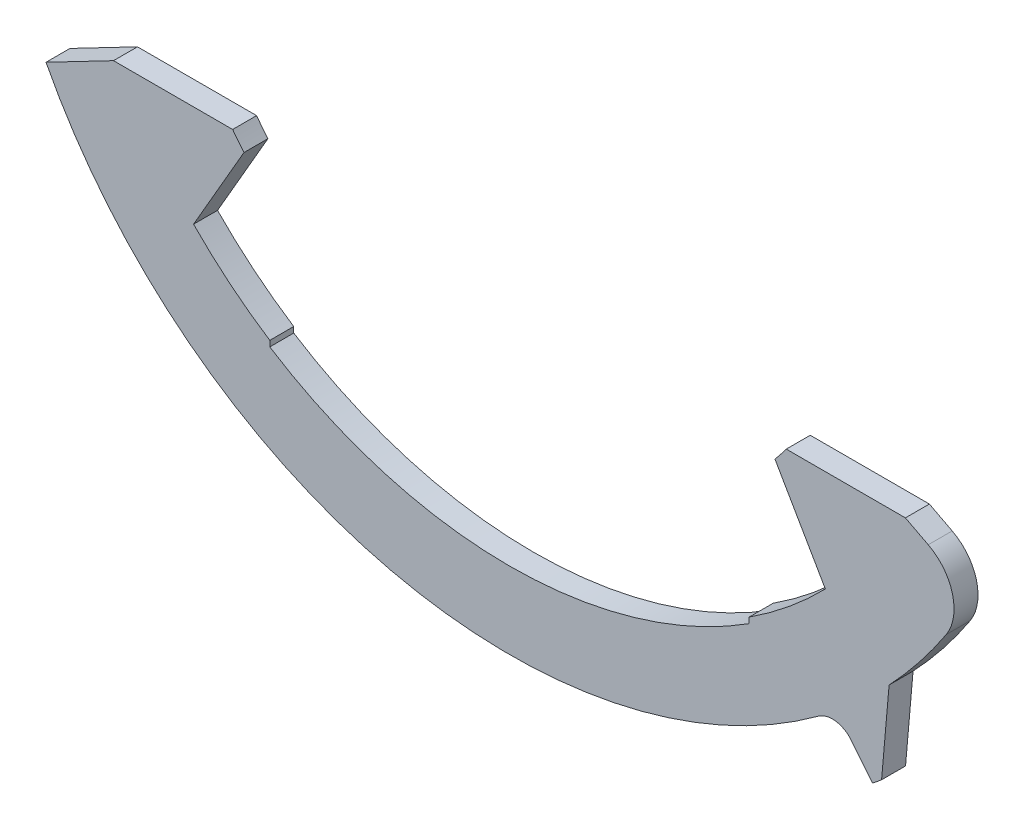
ISO-10303-21;
HEADER;
FILE_DESCRIPTION(('STEP AP214'),'2;1');
FILE_NAME('part.step','',(''),(''),'','','');
FILE_SCHEMA(('AUTOMOTIVE_DESIGN { 1 0 10303 214 1 1 1 1 }'));
ENDSEC;
DATA;
#1=APPLICATION_CONTEXT('core data for automotive mechanical design processes');
#2=APPLICATION_PROTOCOL_DEFINITION('international standard','automotive_design',2000,#1);
#3=PRODUCT_CONTEXT('',#1,'mechanical');
#4=PRODUCT('Part','Part','',(#3));
#5=PRODUCT_RELATED_PRODUCT_CATEGORY('part','',(#4));
#6=PRODUCT_DEFINITION_FORMATION('','',#4);
#7=PRODUCT_DEFINITION_CONTEXT('part definition',#1,'design');
#8=PRODUCT_DEFINITION('design','',#6,#7);
#9=PRODUCT_DEFINITION_SHAPE('','',#8);
#10=(LENGTH_UNIT() NAMED_UNIT(*) SI_UNIT(.MILLI.,.METRE.));
#11=(NAMED_UNIT(*) PLANE_ANGLE_UNIT() SI_UNIT($,.RADIAN.));
#12=(NAMED_UNIT(*) SI_UNIT($,.STERADIAN.) SOLID_ANGLE_UNIT());
#13=UNCERTAINTY_MEASURE_WITH_UNIT(LENGTH_MEASURE(1.E-05),#10,'distance_accuracy_value','');
#14=(GEOMETRIC_REPRESENTATION_CONTEXT(3) GLOBAL_UNCERTAINTY_ASSIGNED_CONTEXT((#13)) GLOBAL_UNIT_ASSIGNED_CONTEXT((#10,
#11,#12)) REPRESENTATION_CONTEXT('',''));
#15=CARTESIAN_POINT('',(0.,0.,0.));
#16=DIRECTION('',(0.,0.,1.));
#17=DIRECTION('',(1.,0.,0.));
#18=AXIS2_PLACEMENT_3D('',#15,#16,#17);
#19=CARTESIAN_POINT('',(6.73871884157739,-9.19508936194586,-0.00100000000000002));
#20=DIRECTION('',(0.,0.,1.));
#21=DIRECTION('',(1.,0.,0.));
#22=AXIS2_PLACEMENT_3D('',#19,#20,#21);
#23=CYLINDRICAL_SURFACE('',#22,0.5);
#24=DIRECTION('',(0.,0.,1.));
#25=VECTOR('',#24,1.);
#26=CARTESIAN_POINT('',(6.44316099764856,-8.79179596887806,-0.00100000000000002));
#27=LINE('',#26,#25);
#28=CARTESIAN_POINT('',(6.44316099764856,-8.79179596887806,0.));
#29=VERTEX_POINT('',#28);
#30=CARTESIAN_POINT('',(6.44316099764856,-8.79179596887806,0.5));
#31=VERTEX_POINT('',#30);
#32=EDGE_CURVE('E181',#29,#31,#27,.T.);
#33=ORIENTED_EDGE('',*,*,#32,.F.);
#34=CARTESIAN_POINT('',(6.73871884157739,-9.19508936194586,0.));
#35=DIRECTION('',(0.,0.,-1.));
#36=DIRECTION('',(-1.,0.,0.));
#37=AXIS2_PLACEMENT_3D('',#34,#35,#36);
#38=CIRCLE('',#37,0.5);
#39=CARTESIAN_POINT('',(7.12866108312383,-8.88212762585383,0.));
#40=VERTEX_POINT('',#39);
#41=EDGE_CURVE('E304',#40,#29,#38,.F.);
#42=ORIENTED_EDGE('',*,*,#41,.F.);
#43=DIRECTION('',(0.,0.,1.));
#44=VECTOR('',#43,1.);
#45=CARTESIAN_POINT('',(7.12866108312383,-8.88212762585383,-0.00100000000000002));
#46=LINE('',#45,#44);
#47=CARTESIAN_POINT('',(7.12866108312383,-8.88212762585383,0.5));
#48=VERTEX_POINT('',#47);
#49=EDGE_CURVE('E313',#40,#48,#46,.T.);
#50=ORIENTED_EDGE('',*,*,#49,.T.);
#51=CARTESIAN_POINT('',(6.73871884157739,-9.19508936194586,0.5));
#52=DIRECTION('',(0.,0.,1.));
#53=DIRECTION('',(0.,1.,0.));
#54=AXIS2_PLACEMENT_3D('',#51,#52,#53);
#55=CIRCLE('',#54,0.5);
#56=EDGE_CURVE('E310',#48,#31,#55,.T.);
#57=ORIENTED_EDGE('',*,*,#56,.T.);
#58=EDGE_LOOP('',(#33,#42,#50,#57));
#59=FACE_BOUND('',#58,.T.);
#60=ADVANCED_FACE('F40',(#59),#23,.F.);
#61=CARTESIAN_POINT('',(0.,0.,0.5));
#62=DIRECTION('',(0.,0.,-1.));
#63=DIRECTION('',(-1.,0.,0.));
#64=AXIS2_PLACEMENT_3D('',#61,#62,#63);
#65=CYLINDRICAL_SURFACE('',#64,12.1);
#66=CARTESIAN_POINT('',(0.,0.,0.));
#67=DIRECTION('',(0.,0.,1.));
#68=DIRECTION('',(1.,0.,0.));
#69=AXIS2_PLACEMENT_3D('',#66,#67,#68);
#70=CIRCLE('',#69,12.1);
#71=CARTESIAN_POINT('',(7.57367401342711,-9.43660224542387,0.));
#72=VERTEX_POINT('',#71);
#73=CARTESIAN_POINT('',(7.76317902804415,-9.28132810423893,0.));
#74=VERTEX_POINT('',#73);
#75=EDGE_CURVE('E235',#72,#74,#70,.T.);
#76=ORIENTED_EDGE('',*,*,#75,.T.);
#77=DIRECTION('',(0.,0.,1.));
#78=VECTOR('',#77,1.);
#79=CARTESIAN_POINT('',(7.76317902804415,-9.28132810423893,-0.00100000000000002));
#80=LINE('',#79,#78);
#81=CARTESIAN_POINT('',(7.76317902804415,-9.28132810423893,0.5));
#82=VERTEX_POINT('',#81);
#83=EDGE_CURVE('E301',#74,#82,#80,.T.);
#84=ORIENTED_EDGE('',*,*,#83,.T.);
#85=CARTESIAN_POINT('',(0.,0.,0.5));
#86=DIRECTION('',(0.,0.,1.));
#87=DIRECTION('',(1.,0.,0.));
#88=AXIS2_PLACEMENT_3D('',#85,#86,#87);
#89=CIRCLE('',#88,12.1);
#90=CARTESIAN_POINT('',(7.57367401342711,-9.43660224542387,0.5));
#91=VERTEX_POINT('',#90);
#92=EDGE_CURVE('E199',#91,#82,#89,.T.);
#93=ORIENTED_EDGE('',*,*,#92,.F.);
#94=DIRECTION('',(0.,0.,1.));
#95=VECTOR('',#94,1.);
#96=CARTESIAN_POINT('',(7.57367401342711,-9.43660224542387,-0.00100000000000002));
#97=LINE('',#96,#95);
#98=EDGE_CURVE('E312',#72,#91,#97,.T.);
#99=ORIENTED_EDGE('',*,*,#98,.F.);
#100=EDGE_LOOP('',(#76,#84,#93,#99));
#101=FACE_BOUND('',#100,.T.);
#102=ADVANCED_FACE('F354',(#101),#65,.T.);
#103=CARTESIAN_POINT('',(0.,0.,0.5));
#104=DIRECTION('',(0.,0.,-1.));
#105=DIRECTION('',(-1.,0.,0.));
#106=AXIS2_PLACEMENT_3D('',#103,#104,#105);
#107=CYLINDRICAL_SURFACE('',#106,7.2);
#108=CARTESIAN_POINT('',(0.,0.,0.));
#109=DIRECTION('',(0.,0.,-1.));
#110=DIRECTION('',(-1.,0.,0.));
#111=AXIS2_PLACEMENT_3D('',#108,#109,#110);
#112=CIRCLE('',#111,7.2);
#113=CARTESIAN_POINT('',(5.77494588719236,-4.3,0.));
#114=VERTEX_POINT('',#113);
#115=CARTESIAN_POINT('',(5.53923133011576,-4.5996647999027,0.));
#116=VERTEX_POINT('',#115);
#117=EDGE_CURVE('E212',#114,#116,#112,.T.);
#118=ORIENTED_EDGE('',*,*,#117,.T.);
#119=DIRECTION('',(0.,0.,-1.));
#120=VECTOR('',#119,1.);
#121=CARTESIAN_POINT('',(5.53923133011576,-4.5996647999027,0.5));
#122=LINE('',#121,#120);
#123=CARTESIAN_POINT('',(5.53923133011576,-4.5996647999027,0.5));
#124=VERTEX_POINT('',#123);
#125=EDGE_CURVE('E274',#124,#116,#122,.T.);
#126=ORIENTED_EDGE('',*,*,#125,.F.);
#127=CARTESIAN_POINT('',(0.,0.,0.5));
#128=DIRECTION('',(0.,0.,-1.));
#129=DIRECTION('',(-1.,0.,0.));
#130=AXIS2_PLACEMENT_3D('',#127,#128,#129);
#131=CIRCLE('',#130,7.2);
#132=CARTESIAN_POINT('',(5.77494588719236,-4.3,0.5));
#133=VERTEX_POINT('',#132);
#134=EDGE_CURVE('E242',#133,#124,#131,.T.);
#135=ORIENTED_EDGE('',*,*,#134,.F.);
#136=DIRECTION('',(0.,0.,-1.));
#137=VECTOR('',#136,1.);
#138=CARTESIAN_POINT('',(5.77494588719236,-4.3,0.5));
#139=LINE('',#138,#137);
#140=EDGE_CURVE('E211',#133,#114,#139,.T.);
#141=ORIENTED_EDGE('',*,*,#140,.T.);
#142=EDGE_LOOP('',(#118,#126,#135,#141));
#143=FACE_BOUND('',#142,.T.);
#144=ADVANCED_FACE('F365',(#143),#107,.F.);
#145=CARTESIAN_POINT('',(5.53923133011576,-4.5996647999027,0.5));
#146=DIRECTION('',(0.866025403784438,0.500000000000001,0.));
#147=DIRECTION('',(-0.500000000000001,0.866025403784438,0.));
#148=AXIS2_PLACEMENT_3D('',#145,#146,#147);
#149=PLANE('',#148);
#150=DIRECTION('',(0.500000000000001,-0.866025403784438,0.));
#151=VECTOR('',#150,1.);
#152=CARTESIAN_POINT('',(5.53923133011576,-4.5996647999027,0.));
#153=LINE('',#152,#151);
#154=CARTESIAN_POINT('',(6.59,-6.41964952314377,0.));
#155=VERTEX_POINT('',#154);
#156=EDGE_CURVE('E215',#116,#155,#153,.T.);
#157=ORIENTED_EDGE('',*,*,#156,.T.);
#158=DIRECTION('',(0.,0.,-1.));
#159=VECTOR('',#158,1.);
#160=CARTESIAN_POINT('',(6.59,-6.41964952314377,0.5));
#161=LINE('',#160,#159);
#162=CARTESIAN_POINT('',(6.59,-6.41964952314377,0.5));
#163=VERTEX_POINT('',#162);
#164=EDGE_CURVE('E271',#163,#155,#161,.T.);
#165=ORIENTED_EDGE('',*,*,#164,.F.);
#166=DIRECTION('',(0.500000000000001,-0.866025403784438,0.));
#167=VECTOR('',#166,1.);
#168=CARTESIAN_POINT('',(5.53923133011576,-4.5996647999027,0.5));
#169=LINE('',#168,#167);
#170=EDGE_CURVE('E320',#124,#163,#169,.T.);
#171=ORIENTED_EDGE('',*,*,#170,.F.);
#172=ORIENTED_EDGE('',*,*,#125,.T.);
#173=EDGE_LOOP('',(#157,#165,#171,#172));
#174=FACE_BOUND('',#173,.T.);
#175=ADVANCED_FACE('F412',(#174),#149,.F.);
#176=CARTESIAN_POINT('',(0.,0.,0.5));
#177=DIRECTION('',(0.,0.,-1.));
#178=DIRECTION('',(-1.,0.,0.));
#179=AXIS2_PLACEMENT_3D('',#176,#177,#178);
#180=CYLINDRICAL_SURFACE('',#179,9.2);
#181=CARTESIAN_POINT('',(0.,0.,0.));
#182=DIRECTION('',(0.,0.,-1.));
#183=DIRECTION('',(1.,0.,0.));
#184=AXIS2_PLACEMENT_3D('',#181,#182,#183);
#185=CIRCLE('',#184,9.2);
#186=CARTESIAN_POINT('',(5.,-7.72269383052313,0.));
#187=VERTEX_POINT('',#186);
#188=EDGE_CURVE('E218',#155,#187,#185,.T.);
#189=ORIENTED_EDGE('',*,*,#188,.T.);
#190=DIRECTION('',(0.,0.,-1.));
#191=VECTOR('',#190,1.);
#192=CARTESIAN_POINT('',(5.,-7.72269383052313,0.5));
#193=LINE('',#192,#191);
#194=CARTESIAN_POINT('',(5.,-7.72269383052313,0.5));
#195=VERTEX_POINT('',#194);
#196=EDGE_CURVE('E268',#195,#187,#193,.T.);
#197=ORIENTED_EDGE('',*,*,#196,.F.);
#198=CARTESIAN_POINT('',(0.,0.,0.5));
#199=DIRECTION('',(0.,0.,-1.));
#200=DIRECTION('',(1.,0.,0.));
#201=AXIS2_PLACEMENT_3D('',#198,#199,#200);
#202=CIRCLE('',#201,9.2);
#203=EDGE_CURVE('E322',#163,#195,#202,.T.);
#204=ORIENTED_EDGE('',*,*,#203,.F.);
#205=ORIENTED_EDGE('',*,*,#164,.T.);
#206=EDGE_LOOP('',(#189,#197,#204,#205));
#207=FACE_BOUND('',#206,.T.);
#208=ADVANCED_FACE('F408',(#207),#180,.F.);
#209=CARTESIAN_POINT('',(5.,-7.72269383052313,0.5));
#210=DIRECTION('',(1.,0.,0.));
#211=DIRECTION('',(0.,0.,-1.));
#212=AXIS2_PLACEMENT_3D('',#209,#210,#211);
#213=PLANE('',#212);
#214=DIRECTION('',(0.,-1.,0.));
#215=VECTOR('',#214,1.);
#216=CARTESIAN_POINT('',(5.,-7.72269383052313,0.));
#217=LINE('',#216,#215);
#218=CARTESIAN_POINT('',(4.99999999999999,-7.84155596804614,0.));
#219=VERTEX_POINT('',#218);
#220=EDGE_CURVE('E220',#187,#219,#217,.T.);
#221=ORIENTED_EDGE('',*,*,#220,.T.);
#222=DIRECTION('',(0.,0.,-1.));
#223=VECTOR('',#222,1.);
#224=CARTESIAN_POINT('',(4.99999999999999,-7.84155596804614,0.5));
#225=LINE('',#224,#223);
#226=CARTESIAN_POINT('',(4.99999999999999,-7.84155596804614,0.5));
#227=VERTEX_POINT('',#226);
#228=EDGE_CURVE('E265',#227,#219,#225,.T.);
#229=ORIENTED_EDGE('',*,*,#228,.F.);
#230=DIRECTION('',(0.,-1.,0.));
#231=VECTOR('',#230,1.);
#232=CARTESIAN_POINT('',(5.,-7.72269383052313,0.5));
#233=LINE('',#232,#231);
#234=EDGE_CURVE('E324',#195,#227,#233,.T.);
#235=ORIENTED_EDGE('',*,*,#234,.F.);
#236=ORIENTED_EDGE('',*,*,#196,.T.);
#237=EDGE_LOOP('',(#221,#229,#235,#236));
#238=FACE_BOUND('',#237,.T.);
#239=ADVANCED_FACE('F404',(#238),#213,.F.);
#240=CARTESIAN_POINT('',(0.,0.,0.5));
#241=DIRECTION('',(0.,0.,-1.));
#242=DIRECTION('',(-1.,0.,0.));
#243=AXIS2_PLACEMENT_3D('',#240,#241,#242);
#244=CYLINDRICAL_SURFACE('',#243,9.3);
#245=CARTESIAN_POINT('',(0.,0.,0.));
#246=DIRECTION('',(0.,0.,-1.));
#247=DIRECTION('',(1.,0.,0.));
#248=AXIS2_PLACEMENT_3D('',#245,#246,#247);
#249=CIRCLE('',#248,9.3);
#250=CARTESIAN_POINT('',(-5.,-7.84155596804614,0.));
#251=VERTEX_POINT('',#250);
#252=EDGE_CURVE('E222',#219,#251,#249,.T.);
#253=ORIENTED_EDGE('',*,*,#252,.T.);
#254=DIRECTION('',(0.,0.,-1.));
#255=VECTOR('',#254,1.);
#256=CARTESIAN_POINT('',(-5.,-7.84155596804614,0.5));
#257=LINE('',#256,#255);
#258=CARTESIAN_POINT('',(-5.,-7.84155596804614,0.5));
#259=VERTEX_POINT('',#258);
#260=EDGE_CURVE('E262',#259,#251,#257,.T.);
#261=ORIENTED_EDGE('',*,*,#260,.F.);
#262=CARTESIAN_POINT('',(0.,0.,0.5));
#263=DIRECTION('',(0.,0.,-1.));
#264=DIRECTION('',(1.,0.,0.));
#265=AXIS2_PLACEMENT_3D('',#262,#263,#264);
#266=CIRCLE('',#265,9.3);
#267=EDGE_CURVE('E326',#227,#259,#266,.T.);
#268=ORIENTED_EDGE('',*,*,#267,.F.);
#269=ORIENTED_EDGE('',*,*,#228,.T.);
#270=EDGE_LOOP('',(#253,#261,#268,#269));
#271=FACE_BOUND('',#270,.T.);
#272=ADVANCED_FACE('F400',(#271),#244,.F.);
#273=CARTESIAN_POINT('',(-5.,-7.72269383052313,0.5));
#274=DIRECTION('',(-1.,0.,0.));
#275=DIRECTION('',(0.,0.,1.));
#276=AXIS2_PLACEMENT_3D('',#273,#274,#275);
#277=PLANE('',#276);
#278=DIRECTION('',(0.,1.,0.));
#279=VECTOR('',#278,1.);
#280=CARTESIAN_POINT('',(-5.,-7.72269383052313,0.));
#281=LINE('',#280,#279);
#282=CARTESIAN_POINT('',(-5.00000000000001,-7.72269383052313,0.));
#283=VERTEX_POINT('',#282);
#284=EDGE_CURVE('E224',#251,#283,#281,.T.);
#285=ORIENTED_EDGE('',*,*,#284,.T.);
#286=DIRECTION('',(0.,0.,-1.));
#287=VECTOR('',#286,1.);
#288=CARTESIAN_POINT('',(-5.00000000000001,-7.72269383052313,0.5));
#289=LINE('',#288,#287);
#290=CARTESIAN_POINT('',(-5.00000000000001,-7.72269383052313,0.5));
#291=VERTEX_POINT('',#290);
#292=EDGE_CURVE('E259',#291,#283,#289,.T.);
#293=ORIENTED_EDGE('',*,*,#292,.F.);
#294=DIRECTION('',(0.,1.,0.));
#295=VECTOR('',#294,1.);
#296=CARTESIAN_POINT('',(-5.,-7.72269383052313,0.5));
#297=LINE('',#296,#295);
#298=EDGE_CURVE('E328',#259,#291,#297,.T.);
#299=ORIENTED_EDGE('',*,*,#298,.F.);
#300=ORIENTED_EDGE('',*,*,#260,.T.);
#301=EDGE_LOOP('',(#285,#293,#299,#300));
#302=FACE_BOUND('',#301,.T.);
#303=ADVANCED_FACE('F396',(#302),#277,.F.);
#304=CARTESIAN_POINT('',(0.,0.,0.5));
#305=DIRECTION('',(0.,0.,-1.));
#306=DIRECTION('',(-1.,0.,0.));
#307=AXIS2_PLACEMENT_3D('',#304,#305,#306);
#308=CYLINDRICAL_SURFACE('',#307,9.2);
#309=CARTESIAN_POINT('',(0.,0.,0.));
#310=DIRECTION('',(0.,0.,-1.));
#311=DIRECTION('',(1.,0.,0.));
#312=AXIS2_PLACEMENT_3D('',#309,#310,#311);
#313=CIRCLE('',#312,9.2);
#314=CARTESIAN_POINT('',(-6.59,-6.41964952314377,0.));
#315=VERTEX_POINT('',#314);
#316=EDGE_CURVE('E226',#283,#315,#313,.T.);
#317=ORIENTED_EDGE('',*,*,#316,.T.);
#318=DIRECTION('',(0.,0.,-1.));
#319=VECTOR('',#318,1.);
#320=CARTESIAN_POINT('',(-6.59,-6.41964952314377,0.5));
#321=LINE('',#320,#319);
#322=CARTESIAN_POINT('',(-6.59,-6.41964952314377,0.5));
#323=VERTEX_POINT('',#322);
#324=EDGE_CURVE('E256',#323,#315,#321,.T.);
#325=ORIENTED_EDGE('',*,*,#324,.F.);
#326=CARTESIAN_POINT('',(0.,0.,0.5));
#327=DIRECTION('',(0.,0.,-1.));
#328=DIRECTION('',(1.,0.,0.));
#329=AXIS2_PLACEMENT_3D('',#326,#327,#328);
#330=CIRCLE('',#329,9.2);
#331=EDGE_CURVE('E330',#291,#323,#330,.T.);
#332=ORIENTED_EDGE('',*,*,#331,.F.);
#333=ORIENTED_EDGE('',*,*,#292,.T.);
#334=EDGE_LOOP('',(#317,#325,#332,#333));
#335=FACE_BOUND('',#334,.T.);
#336=ADVANCED_FACE('F392',(#335),#308,.F.);
#337=CARTESIAN_POINT('',(-5.53923133011576,-4.5996647999027,0.5));
#338=DIRECTION('',(-0.866025403784438,0.500000000000001,0.));
#339=DIRECTION('',(-0.500000000000001,-0.866025403784438,0.));
#340=AXIS2_PLACEMENT_3D('',#337,#338,#339);
#341=PLANE('',#340);
#342=DIRECTION('',(0.500000000000001,0.866025403784438,0.));
#343=VECTOR('',#342,1.);
#344=CARTESIAN_POINT('',(-5.53923133011576,-4.5996647999027,0.));
#345=LINE('',#344,#343);
#346=CARTESIAN_POINT('',(-5.53923133011576,-4.5996647999027,0.));
#347=VERTEX_POINT('',#346);
#348=EDGE_CURVE('E228',#315,#347,#345,.T.);
#349=ORIENTED_EDGE('',*,*,#348,.T.);
#350=DIRECTION('',(0.,0.,-1.));
#351=VECTOR('',#350,1.);
#352=CARTESIAN_POINT('',(-5.53923133011576,-4.5996647999027,0.5));
#353=LINE('',#352,#351);
#354=CARTESIAN_POINT('',(-5.53923133011576,-4.5996647999027,0.5));
#355=VERTEX_POINT('',#354);
#356=EDGE_CURVE('E253',#355,#347,#353,.T.);
#357=ORIENTED_EDGE('',*,*,#356,.F.);
#358=DIRECTION('',(0.500000000000001,0.866025403784438,0.));
#359=VECTOR('',#358,1.);
#360=CARTESIAN_POINT('',(-5.53923133011576,-4.5996647999027,0.5));
#361=LINE('',#360,#359);
#362=EDGE_CURVE('E332',#323,#355,#361,.T.);
#363=ORIENTED_EDGE('',*,*,#362,.F.);
#364=ORIENTED_EDGE('',*,*,#324,.T.);
#365=EDGE_LOOP('',(#349,#357,#363,#364));
#366=FACE_BOUND('',#365,.T.);
#367=ADVANCED_FACE('F389',(#366),#341,.F.);
#368=CARTESIAN_POINT('',(0.,0.,0.5));
#369=DIRECTION('',(0.,0.,-1.));
#370=DIRECTION('',(-1.,0.,0.));
#371=AXIS2_PLACEMENT_3D('',#368,#369,#370);
#372=CYLINDRICAL_SURFACE('',#371,7.2);
#373=CARTESIAN_POINT('',(0.,0.,0.));
#374=DIRECTION('',(0.,0.,-1.));
#375=DIRECTION('',(1.,0.,0.));
#376=AXIS2_PLACEMENT_3D('',#373,#374,#375);
#377=CIRCLE('',#376,7.2);
#378=CARTESIAN_POINT('',(-5.77494588719236,-4.3,0.));
#379=VERTEX_POINT('',#378);
#380=EDGE_CURVE('E230',#347,#379,#377,.T.);
#381=ORIENTED_EDGE('',*,*,#380,.T.);
#382=DIRECTION('',(0.,0.,-1.));
#383=VECTOR('',#382,1.);
#384=CARTESIAN_POINT('',(-5.77494588719236,-4.3,0.5));
#385=LINE('',#384,#383);
#386=CARTESIAN_POINT('',(-5.77494588719236,-4.3,0.5));
#387=VERTEX_POINT('',#386);
#388=EDGE_CURVE('E250',#387,#379,#385,.T.);
#389=ORIENTED_EDGE('',*,*,#388,.F.);
#390=CARTESIAN_POINT('',(0.,0.,0.5));
#391=DIRECTION('',(0.,0.,-1.));
#392=DIRECTION('',(1.,0.,0.));
#393=AXIS2_PLACEMENT_3D('',#390,#391,#392);
#394=CIRCLE('',#393,7.2);
#395=EDGE_CURVE('E204',#355,#387,#394,.T.);
#396=ORIENTED_EDGE('',*,*,#395,.F.);
#397=ORIENTED_EDGE('',*,*,#356,.T.);
#398=EDGE_LOOP('',(#381,#389,#396,#397));
#399=FACE_BOUND('',#398,.T.);
#400=ADVANCED_FACE('F338',(#399),#372,.F.);
#401=CARTESIAN_POINT('',(-8.26022314597606,-4.3,0.5));
#402=DIRECTION('',(0.,-1.,0.));
#403=DIRECTION('',(1.,0.,0.));
#404=AXIS2_PLACEMENT_3D('',#401,#402,#403);
#405=PLANE('',#404);
#406=DIRECTION('',(-1.,0.,0.));
#407=VECTOR('',#406,1.);
#408=CARTESIAN_POINT('',(-8.26022314597606,-4.3,0.));
#409=LINE('',#408,#407);
#410=CARTESIAN_POINT('',(-8.26022314597606,-4.3,0.));
#411=VERTEX_POINT('',#410);
#412=EDGE_CURVE('E232',#379,#411,#409,.T.);
#413=ORIENTED_EDGE('',*,*,#412,.T.);
#414=DIRECTION('',(0.,0.,-1.));
#415=VECTOR('',#414,1.);
#416=CARTESIAN_POINT('',(-8.26022314597606,-4.3,0.5));
#417=LINE('',#416,#415);
#418=CARTESIAN_POINT('',(-8.26022314597606,-4.3,0.5));
#419=VERTEX_POINT('',#418);
#420=EDGE_CURVE('E248',#419,#411,#417,.T.);
#421=ORIENTED_EDGE('',*,*,#420,.F.);
#422=DIRECTION('',(-1.,0.,0.));
#423=VECTOR('',#422,1.);
#424=CARTESIAN_POINT('',(-8.26022314597606,-4.3,0.5));
#425=LINE('',#424,#423);
#426=EDGE_CURVE('E197',#387,#419,#425,.T.);
#427=ORIENTED_EDGE('',*,*,#426,.F.);
#428=ORIENTED_EDGE('',*,*,#388,.T.);
#429=EDGE_LOOP('',(#413,#421,#427,#428));
#430=FACE_BOUND('',#429,.T.);
#431=ADVANCED_FACE('F342',(#430),#405,.F.);
#432=CARTESIAN_POINT('',(-8.26022314597606,-4.3,0.5));
#433=DIRECTION('',(0.461748613235031,-0.887010833178223,0.));
#434=DIRECTION('',(0.887010833178223,0.461748613235031,0.));
#435=AXIS2_PLACEMENT_3D('',#432,#433,#434);
#436=PLANE('',#435);
#437=DIRECTION('',(-0.887010833178223,-0.461748613235031,0.));
#438=VECTOR('',#437,1.);
#439=CARTESIAN_POINT('',(-8.26022314597606,-4.3,0.));
#440=LINE('',#439,#438);
#441=CARTESIAN_POINT('',(-9.66841808164263,-5.03305988426184,0.));
#442=VERTEX_POINT('',#441);
#443=EDGE_CURVE('E193',#411,#442,#440,.T.);
#444=ORIENTED_EDGE('',*,*,#443,.T.);
#445=DIRECTION('',(0.,0.,1.));
#446=VECTOR('',#445,1.);
#447=CARTESIAN_POINT('',(-9.66841808164263,-5.03305988426184,-0.00100000000000002));
#448=LINE('',#447,#446);
#449=CARTESIAN_POINT('',(-9.66841808164263,-5.03305988426184,0.5));
#450=VERTEX_POINT('',#449);
#451=EDGE_CURVE('E178',#442,#450,#448,.T.);
#452=ORIENTED_EDGE('',*,*,#451,.T.);
#453=DIRECTION('',(-0.887010833178223,-0.461748613235031,0.));
#454=VECTOR('',#453,1.);
#455=CARTESIAN_POINT('',(-8.26022314597606,-4.3,0.5));
#456=LINE('',#455,#454);
#457=EDGE_CURVE('E191',#419,#450,#456,.T.);
#458=ORIENTED_EDGE('',*,*,#457,.F.);
#459=ORIENTED_EDGE('',*,*,#420,.T.);
#460=EDGE_LOOP('',(#444,#452,#458,#459));
#461=FACE_BOUND('',#460,.T.);
#462=ADVANCED_FACE('F189',(#461),#436,.F.);
#463=CARTESIAN_POINT('',(8.26022314597606,-4.3,0.5));
#464=DIRECTION('',(-0.461748613235032,-0.887010833178223,0.));
#465=DIRECTION('',(0.887010833178223,-0.461748613235032,0.));
#466=AXIS2_PLACEMENT_3D('',#463,#464,#465);
#467=PLANE('',#466);
#468=DIRECTION('',(-0.887010833178223,0.461748613235032,0.));
#469=VECTOR('',#468,1.);
#470=CARTESIAN_POINT('',(8.26022314597606,-4.3,0.5));
#471=LINE('',#470,#469);
#472=CARTESIAN_POINT('',(8.73649386454358,-4.54793084322885,0.5));
#473=VERTEX_POINT('',#472);
#474=CARTESIAN_POINT('',(8.26022314597606,-4.3,0.5));
#475=VERTEX_POINT('',#474);
#476=EDGE_CURVE('E202',#473,#475,#471,.T.);
#477=ORIENTED_EDGE('',*,*,#476,.F.);
#478=DIRECTION('',(0.,0.,1.));
#479=VECTOR('',#478,1.);
#480=CARTESIAN_POINT('',(8.73649386454358,-4.54793084322885,0.5));
#481=LINE('',#480,#479);
#482=CARTESIAN_POINT('',(8.73649386454358,-4.54793084322885,0.));
#483=VERTEX_POINT('',#482);
#484=EDGE_CURVE('E48',#473,#483,#481,.F.);
#485=ORIENTED_EDGE('',*,*,#484,.T.);
#486=DIRECTION('',(-0.887010833178223,0.461748613235032,0.));
#487=VECTOR('',#486,1.);
#488=CARTESIAN_POINT('',(8.26022314597606,-4.3,0.));
#489=LINE('',#488,#487);
#490=CARTESIAN_POINT('',(8.26022314597606,-4.3,0.));
#491=VERTEX_POINT('',#490);
#492=EDGE_CURVE('E238',#483,#491,#489,.T.);
#493=ORIENTED_EDGE('',*,*,#492,.T.);
#494=DIRECTION('',(0.,0.,-1.));
#495=VECTOR('',#494,1.);
#496=CARTESIAN_POINT('',(8.26022314597606,-4.3,0.5));
#497=LINE('',#496,#495);
#498=EDGE_CURVE('E245',#475,#491,#497,.T.);
#499=ORIENTED_EDGE('',*,*,#498,.F.);
#500=EDGE_LOOP('',(#477,#485,#493,#499));
#501=FACE_BOUND('',#500,.T.);
#502=ADVANCED_FACE('F379',(#501),#467,.F.);
#503=CARTESIAN_POINT('',(5.77494588719236,-4.3,0.5));
#504=DIRECTION('',(0.,-1.,0.));
#505=DIRECTION('',(1.,0.,0.));
#506=AXIS2_PLACEMENT_3D('',#503,#504,#505);
#507=PLANE('',#506);
#508=DIRECTION('',(-1.,0.,0.));
#509=VECTOR('',#508,1.);
#510=CARTESIAN_POINT('',(5.77494588719236,-4.3,0.));
#511=LINE('',#510,#509);
#512=EDGE_CURVE('E240',#491,#114,#511,.T.);
#513=ORIENTED_EDGE('',*,*,#512,.T.);
#514=ORIENTED_EDGE('',*,*,#140,.F.);
#515=DIRECTION('',(-1.,0.,0.));
#516=VECTOR('',#515,1.);
#517=CARTESIAN_POINT('',(5.77494588719236,-4.3,0.5));
#518=LINE('',#517,#516);
#519=EDGE_CURVE('E209',#475,#133,#518,.T.);
#520=ORIENTED_EDGE('',*,*,#519,.F.);
#521=ORIENTED_EDGE('',*,*,#498,.T.);
#522=EDGE_LOOP('',(#513,#514,#520,#521));
#523=FACE_BOUND('',#522,.T.);
#524=ADVANCED_FACE('F374',(#523),#507,.F.);
#525=CARTESIAN_POINT('',(0.,0.,0.5));
#526=DIRECTION('',(0.,0.,-1.));
#527=DIRECTION('',(-1.,0.,0.));
#528=AXIS2_PLACEMENT_3D('',#525,#526,#527);
#529=PLANE('',#528);
#530=ORIENTED_EDGE('',*,*,#457,.T.);
#531=CARTESIAN_POINT('',(0.,0.,0.5));
#532=DIRECTION('',(0.,0.,-1.));
#533=DIRECTION('',(1.,0.,0.));
#534=AXIS2_PLACEMENT_3D('',#531,#532,#533);
#535=CIRCLE('',#534,10.9);
#536=EDGE_CURVE('E175',#31,#450,#535,.T.);
#537=ORIENTED_EDGE('',*,*,#536,.F.);
#538=ORIENTED_EDGE('',*,*,#56,.F.);
#539=DIRECTION('',(-0.625923472184058,0.779884483092882,0.));
#540=VECTOR('',#539,1.);
#541=CARTESIAN_POINT('',(7.12866108312383,-8.88212762585383,0.5));
#542=LINE('',#541,#540);
#543=EDGE_CURVE('E307',#91,#48,#542,.T.);
#544=ORIENTED_EDGE('',*,*,#543,.F.);
#545=ORIENTED_EDGE('',*,*,#92,.T.);
#546=DIRECTION('',(-0.0871557427476539,-0.996194698091746,0.));
#547=VECTOR('',#546,1.);
#548=CARTESIAN_POINT('',(7.76317902804415,-9.28132810423893,0.5));
#549=LINE('',#548,#547);
#550=CARTESIAN_POINT('',(7.91999592597633,-7.48890275891724,0.5));
#551=VERTEX_POINT('',#550);
#552=EDGE_CURVE('E290',#551,#82,#549,.T.);
#553=ORIENTED_EDGE('',*,*,#552,.F.);
#554=CARTESIAN_POINT('',(0.,0.,0.5));
#555=DIRECTION('',(0.,0.,-1.));
#556=DIRECTION('',(-1.,0.,0.));
#557=AXIS2_PLACEMENT_3D('',#554,#555,#556);
#558=CIRCLE('',#557,10.9);
#559=CARTESIAN_POINT('',(9.11057810497609,-5.98392568412496,0.5));
#560=VERTEX_POINT('',#559);
#561=EDGE_CURVE('E285',#560,#551,#558,.T.);
#562=ORIENTED_EDGE('',*,*,#561,.F.);
#563=CARTESIAN_POINT('',(8.27474525130855,-5.43494167640707,0.5));
#564=DIRECTION('',(0.,0.,-1.));
#565=DIRECTION('',(-1.,0.,0.));
#566=AXIS2_PLACEMENT_3D('',#563,#564,#565);
#567=CIRCLE('',#566,1.);
#568=EDGE_CURVE('E62',#560,#473,#567,.F.);
#569=ORIENTED_EDGE('',*,*,#568,.T.);
#570=ORIENTED_EDGE('',*,*,#476,.T.);
#571=ORIENTED_EDGE('',*,*,#519,.T.);
#572=ORIENTED_EDGE('',*,*,#134,.T.);
#573=ORIENTED_EDGE('',*,*,#170,.T.);
#574=ORIENTED_EDGE('',*,*,#203,.T.);
#575=ORIENTED_EDGE('',*,*,#234,.T.);
#576=ORIENTED_EDGE('',*,*,#267,.T.);
#577=ORIENTED_EDGE('',*,*,#298,.T.);
#578=ORIENTED_EDGE('',*,*,#331,.T.);
#579=ORIENTED_EDGE('',*,*,#362,.T.);
#580=ORIENTED_EDGE('',*,*,#395,.T.);
#581=ORIENTED_EDGE('',*,*,#426,.T.);
#582=EDGE_LOOP('',(#530,#537,#538,#544,#545,#553,#562,#569,#570,#571,#572,#573,#574,#575,#576,
#577,#578,#579,#580,#581));
#583=FACE_BOUND('',#582,.T.);
#584=ADVANCED_FACE('F195',(#583),#529,.F.);
#585=CARTESIAN_POINT('',(0.,0.,0.));
#586=DIRECTION('',(0.,0.,-1.));
#587=DIRECTION('',(-1.,0.,0.));
#588=AXIS2_PLACEMENT_3D('',#585,#586,#587);
#589=PLANE('',#588);
#590=CARTESIAN_POINT('',(0.,0.,0.));
#591=DIRECTION('',(0.,0.,-1.));
#592=DIRECTION('',(-1.,0.,0.));
#593=AXIS2_PLACEMENT_3D('',#590,#591,#592);
#594=CIRCLE('',#593,10.9);
#595=EDGE_CURVE('E185',#29,#442,#594,.T.);
#596=ORIENTED_EDGE('',*,*,#595,.T.);
#597=ORIENTED_EDGE('',*,*,#443,.F.);
#598=ORIENTED_EDGE('',*,*,#412,.F.);
#599=ORIENTED_EDGE('',*,*,#380,.F.);
#600=ORIENTED_EDGE('',*,*,#348,.F.);
#601=ORIENTED_EDGE('',*,*,#316,.F.);
#602=ORIENTED_EDGE('',*,*,#284,.F.);
#603=ORIENTED_EDGE('',*,*,#252,.F.);
#604=ORIENTED_EDGE('',*,*,#220,.F.);
#605=ORIENTED_EDGE('',*,*,#188,.F.);
#606=ORIENTED_EDGE('',*,*,#156,.F.);
#607=ORIENTED_EDGE('',*,*,#117,.F.);
#608=ORIENTED_EDGE('',*,*,#512,.F.);
#609=ORIENTED_EDGE('',*,*,#492,.F.);
#610=CARTESIAN_POINT('',(8.27474525130855,-5.43494167640707,0.));
#611=DIRECTION('',(0.,0.,-1.));
#612=DIRECTION('',(-1.,0.,0.));
#613=AXIS2_PLACEMENT_3D('',#610,#611,#612);
#614=CIRCLE('',#613,1.);
#615=CARTESIAN_POINT('',(9.11057810497609,-5.98392568412496,0.));
#616=VERTEX_POINT('',#615);
#617=EDGE_CURVE('E11',#483,#616,#614,.T.);
#618=ORIENTED_EDGE('',*,*,#617,.T.);
#619=CARTESIAN_POINT('',(0.,0.,0.));
#620=DIRECTION('',(0.,0.,-1.));
#621=DIRECTION('',(-1.,0.,0.));
#622=AXIS2_PLACEMENT_3D('',#619,#620,#621);
#623=CIRCLE('',#622,10.9);
#624=CARTESIAN_POINT('',(7.91999592597633,-7.48890275891724,0.));
#625=VERTEX_POINT('',#624);
#626=EDGE_CURVE('E287',#616,#625,#623,.T.);
#627=ORIENTED_EDGE('',*,*,#626,.T.);
#628=DIRECTION('',(-0.0871557427476539,-0.996194698091746,0.));
#629=VECTOR('',#628,1.);
#630=CARTESIAN_POINT('',(7.76317902804415,-9.28132810423893,0.));
#631=LINE('',#630,#629);
#632=EDGE_CURVE('E292',#625,#74,#631,.T.);
#633=ORIENTED_EDGE('',*,*,#632,.T.);
#634=ORIENTED_EDGE('',*,*,#75,.F.);
#635=DIRECTION('',(-0.625923472184058,0.779884483092882,0.));
#636=VECTOR('',#635,1.);
#637=CARTESIAN_POINT('',(7.12866108312383,-8.88212762585383,0.));
#638=LINE('',#637,#636);
#639=EDGE_CURVE('E216',#72,#40,#638,.T.);
#640=ORIENTED_EDGE('',*,*,#639,.T.);
#641=ORIENTED_EDGE('',*,*,#41,.T.);
#642=EDGE_LOOP('',(#596,#597,#598,#599,#600,#601,#602,#603,#604,#605,#606,#607,#608,#609,#618,
#627,#633,#634,#640,#641));
#643=FACE_BOUND('',#642,.T.);
#644=ADVANCED_FACE('F344',(#643),#589,.T.);
#645=CARTESIAN_POINT('',(7.12866108312383,-8.88212762585383,-0.00100000000000002));
#646=DIRECTION('',(0.779884483092882,0.625923472184058,0.));
#647=DIRECTION('',(-0.625923472184058,0.779884483092882,0.));
#648=AXIS2_PLACEMENT_3D('',#645,#646,#647);
#649=PLANE('',#648);
#650=ORIENTED_EDGE('',*,*,#98,.T.);
#651=ORIENTED_EDGE('',*,*,#543,.T.);
#652=ORIENTED_EDGE('',*,*,#49,.F.);
#653=ORIENTED_EDGE('',*,*,#639,.F.);
#654=EDGE_LOOP('',(#650,#651,#652,#653));
#655=FACE_BOUND('',#654,.T.);
#656=ADVANCED_FACE('F358',(#655),#649,.F.);
#657=CARTESIAN_POINT('',(7.76317902804415,-9.28132810423893,-0.00100000000000002));
#658=DIRECTION('',(-0.996194698091746,0.0871557427476539,0.));
#659=DIRECTION('',(-0.0871557427476539,-0.996194698091746,0.));
#660=AXIS2_PLACEMENT_3D('',#657,#658,#659);
#661=PLANE('',#660);
#662=ORIENTED_EDGE('',*,*,#632,.F.);
#663=DIRECTION('',(0.,0.,1.));
#664=VECTOR('',#663,1.);
#665=CARTESIAN_POINT('',(7.91999592597633,-7.48890275891724,-0.00100000000000002));
#666=LINE('',#665,#664);
#667=EDGE_CURVE('E296',#625,#551,#666,.T.);
#668=ORIENTED_EDGE('',*,*,#667,.T.);
#669=ORIENTED_EDGE('',*,*,#552,.T.);
#670=ORIENTED_EDGE('',*,*,#83,.F.);
#671=EDGE_LOOP('',(#662,#668,#669,#670));
#672=FACE_BOUND('',#671,.T.);
#673=ADVANCED_FACE('F350',(#672),#661,.F.);
#674=CARTESIAN_POINT('',(0.,0.,-0.00100000000000002));
#675=DIRECTION('',(0.,0.,1.));
#676=DIRECTION('',(1.,0.,0.));
#677=AXIS2_PLACEMENT_3D('',#674,#675,#676);
#678=CYLINDRICAL_SURFACE('',#677,10.9);
#679=ORIENTED_EDGE('',*,*,#626,.F.);
#680=DIRECTION('',(0.,0.,1.));
#681=VECTOR('',#680,1.);
#682=CARTESIAN_POINT('',(9.11057810497609,-5.98392568412496,-0.00100000000000002));
#683=LINE('',#682,#681);
#684=EDGE_CURVE('E277',#616,#560,#683,.T.);
#685=ORIENTED_EDGE('',*,*,#684,.T.);
#686=ORIENTED_EDGE('',*,*,#561,.T.);
#687=ORIENTED_EDGE('',*,*,#667,.F.);
#688=EDGE_LOOP('',(#679,#685,#686,#687));
#689=FACE_BOUND('',#688,.T.);
#690=ADVANCED_FACE('F283',(#689),#678,.T.);
#691=CARTESIAN_POINT('',(8.27474525130855,-5.43494167640707,-0.00100000000000002));
#692=DIRECTION('',(0.,0.,1.));
#693=DIRECTION('',(1.,0.,0.));
#694=AXIS2_PLACEMENT_3D('',#691,#692,#693);
#695=CYLINDRICAL_SURFACE('',#694,1.);
#696=ORIENTED_EDGE('',*,*,#617,.F.);
#697=ORIENTED_EDGE('',*,*,#484,.F.);
#698=ORIENTED_EDGE('',*,*,#568,.F.);
#699=ORIENTED_EDGE('',*,*,#684,.F.);
#700=EDGE_LOOP('',(#696,#697,#698,#699));
#701=FACE_BOUND('',#700,.T.);
#702=ADVANCED_FACE('F42',(#701),#695,.T.);
#703=CARTESIAN_POINT('',(0.,0.,-0.00100000000000002));
#704=DIRECTION('',(0.,0.,1.));
#705=DIRECTION('',(1.,0.,0.));
#706=AXIS2_PLACEMENT_3D('',#703,#704,#705);
#707=CYLINDRICAL_SURFACE('',#706,10.9);
#708=ORIENTED_EDGE('',*,*,#595,.F.);
#709=ORIENTED_EDGE('',*,*,#32,.T.);
#710=ORIENTED_EDGE('',*,*,#536,.T.);
#711=ORIENTED_EDGE('',*,*,#451,.F.);
#712=EDGE_LOOP('',(#708,#709,#710,#711));
#713=FACE_BOUND('',#712,.T.);
#714=ADVANCED_FACE('F177',(#713),#707,.T.);
#715=CLOSED_SHELL('',(#60,#102,#144,#175,#208,#239,#272,#303,#336,#367,#400,#431,#462,#502,#524,
#584,#644,#656,#673,#690,#702,#714));
#716=MANIFOLD_SOLID_BREP('B2',#715);
#717=ADVANCED_BREP_SHAPE_REPRESENTATION('',(#18,#716),#14);
#718=SHAPE_DEFINITION_REPRESENTATION(#9,#717);
ENDSEC;
END-ISO-10303-21;
